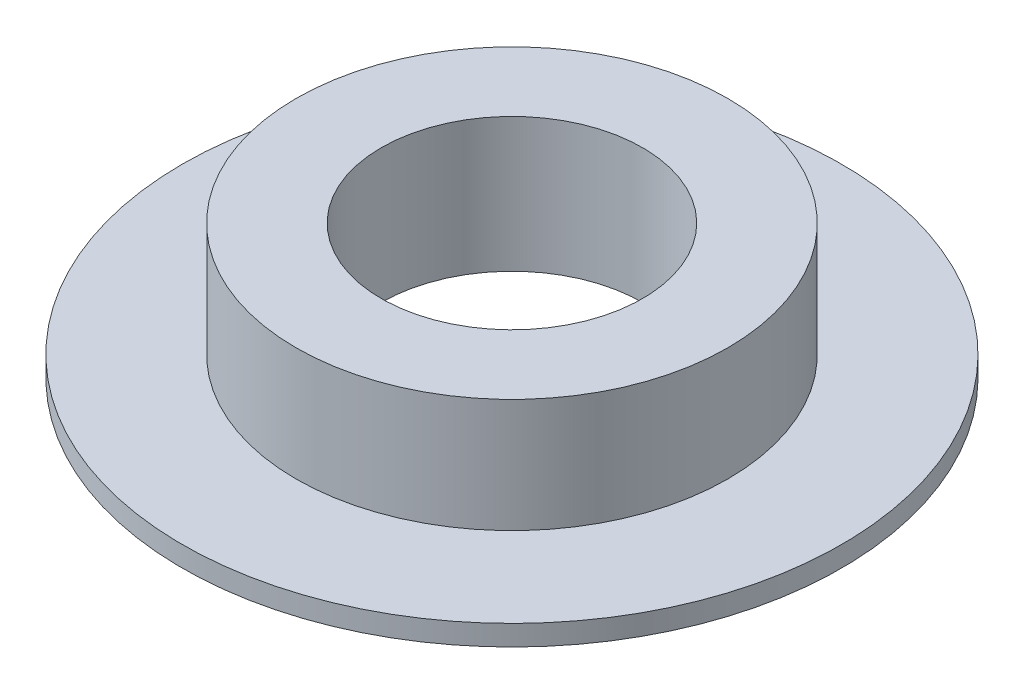
ISO-10303-21;
HEADER;
FILE_DESCRIPTION(('STEP AP214'),'2;1');
FILE_NAME('part.step','',(''),(''),'','','');
FILE_SCHEMA(('AUTOMOTIVE_DESIGN { 1 0 10303 214 1 1 1 1 }'));
ENDSEC;
DATA;
#1=APPLICATION_CONTEXT('core data for automotive mechanical design processes');
#2=APPLICATION_PROTOCOL_DEFINITION('international standard','automotive_design',2000,#1);
#3=PRODUCT_CONTEXT('',#1,'mechanical');
#4=PRODUCT('Part','Part','',(#3));
#5=PRODUCT_RELATED_PRODUCT_CATEGORY('part','',(#4));
#6=PRODUCT_DEFINITION_FORMATION('','',#4);
#7=PRODUCT_DEFINITION_CONTEXT('part definition',#1,'design');
#8=PRODUCT_DEFINITION('design','',#6,#7);
#9=PRODUCT_DEFINITION_SHAPE('','',#8);
#10=(LENGTH_UNIT() NAMED_UNIT(*) SI_UNIT(.MILLI.,.METRE.));
#11=(NAMED_UNIT(*) PLANE_ANGLE_UNIT() SI_UNIT($,.RADIAN.));
#12=(NAMED_UNIT(*) SI_UNIT($,.STERADIAN.) SOLID_ANGLE_UNIT());
#13=UNCERTAINTY_MEASURE_WITH_UNIT(LENGTH_MEASURE(1.E-05),#10,'distance_accuracy_value','');
#14=(GEOMETRIC_REPRESENTATION_CONTEXT(3) GLOBAL_UNCERTAINTY_ASSIGNED_CONTEXT((#13)) GLOBAL_UNIT_ASSIGNED_CONTEXT((#10,
#11,#12)) REPRESENTATION_CONTEXT('',''));
#15=CARTESIAN_POINT('',(0.,0.,0.));
#16=DIRECTION('',(0.,0.,1.));
#17=DIRECTION('',(1.,0.,0.));
#18=AXIS2_PLACEMENT_3D('',#15,#16,#17);
#19=CARTESIAN_POINT('',(-48.5215872800419,8.97288931788123,0.));
#20=DIRECTION('',(0.,1.,0.));
#21=DIRECTION('',(-1.,0.,0.));
#22=AXIS2_PLACEMENT_3D('',#19,#20,#21);
#23=PLANE('',#22);
#24=CARTESIAN_POINT('',(-37.0215872800419,8.97288931788123,0.));
#25=DIRECTION('',(0.,1.,0.));
#26=DIRECTION('',(-1.,0.,0.));
#27=AXIS2_PLACEMENT_3D('',#24,#25,#26);
#28=CIRCLE('',#27,19.);
#29=CARTESIAN_POINT('',(-56.0215872800419,8.97288931788123,0.));
#30=VERTEX_POINT('',#29);
#31=EDGE_CURVE('E10',#30,#30,#28,.T.);
#32=ORIENTED_EDGE('',*,*,#31,.T.);
#33=EDGE_LOOP('',(#32));
#34=FACE_BOUND('',#33,.T.);
#35=CARTESIAN_POINT('',(-37.0215872800419,8.97288931788123,0.));
#36=DIRECTION('',(0.,1.,0.));
#37=DIRECTION('',(-1.,0.,0.));
#38=AXIS2_PLACEMENT_3D('',#35,#36,#37);
#39=CIRCLE('',#38,11.5);
#40=CARTESIAN_POINT('',(-48.5215872800419,8.97288931788123,0.));
#41=VERTEX_POINT('',#40);
#42=EDGE_CURVE('E52',#41,#41,#39,.T.);
#43=ORIENTED_EDGE('',*,*,#42,.F.);
#44=EDGE_LOOP('',(#43));
#45=FACE_BOUND('',#44,.T.);
#46=ADVANCED_FACE('F30',(#34,#45),#23,.T.);
#47=CARTESIAN_POINT('',(-37.0215872800419,13.9728893178812,0.));
#48=DIRECTION('',(0.,1.,0.));
#49=DIRECTION('',(-1.,0.,0.));
#50=AXIS2_PLACEMENT_3D('',#47,#48,#49);
#51=CYLINDRICAL_SURFACE('',#50,19.);
#52=CARTESIAN_POINT('',(-37.0215872800419,-1.02711068211877,0.));
#53=DIRECTION('',(0.,1.,0.));
#54=DIRECTION('',(-1.,0.,0.));
#55=AXIS2_PLACEMENT_3D('',#52,#53,#54);
#56=CIRCLE('',#55,19.);
#57=CARTESIAN_POINT('',(-56.0215872800419,-1.02711068211877,0.));
#58=VERTEX_POINT('',#57);
#59=EDGE_CURVE('E36',#58,#58,#56,.T.);
#60=ORIENTED_EDGE('',*,*,#59,.T.);
#61=EDGE_LOOP('',(#60));
#62=FACE_BOUND('',#61,.T.);
#63=ORIENTED_EDGE('',*,*,#31,.F.);
#64=EDGE_LOOP('',(#63));
#65=FACE_BOUND('',#64,.T.);
#66=ADVANCED_FACE('F60',(#62,#65),#51,.T.);
#67=CARTESIAN_POINT('',(-56.0215872800419,-1.02711068211877,0.));
#68=DIRECTION('',(0.,1.,0.));
#69=DIRECTION('',(-1.,0.,0.));
#70=AXIS2_PLACEMENT_3D('',#67,#68,#69);
#71=PLANE('',#70);
#72=CARTESIAN_POINT('',(-37.0215872800419,-1.02711068211877,0.));
#73=DIRECTION('',(0.,1.,0.));
#74=DIRECTION('',(-1.,0.,0.));
#75=AXIS2_PLACEMENT_3D('',#72,#73,#74);
#76=CIRCLE('',#75,29.);
#77=CARTESIAN_POINT('',(-66.0215872800419,-1.02711068211877,0.));
#78=VERTEX_POINT('',#77);
#79=EDGE_CURVE('E40',#78,#78,#76,.T.);
#80=ORIENTED_EDGE('',*,*,#79,.T.);
#81=EDGE_LOOP('',(#80));
#82=FACE_BOUND('',#81,.T.);
#83=ORIENTED_EDGE('',*,*,#59,.F.);
#84=EDGE_LOOP('',(#83));
#85=FACE_BOUND('',#84,.T.);
#86=ADVANCED_FACE('F64',(#82,#85),#71,.T.);
#87=CARTESIAN_POINT('',(-37.0215872800419,13.9728893178812,0.));
#88=DIRECTION('',(0.,1.,0.));
#89=DIRECTION('',(-1.,0.,0.));
#90=AXIS2_PLACEMENT_3D('',#87,#88,#89);
#91=CYLINDRICAL_SURFACE('',#90,29.);
#92=CARTESIAN_POINT('',(-37.0215872800419,-2.82711068211877,0.));
#93=DIRECTION('',(0.,1.,0.));
#94=DIRECTION('',(-1.,0.,0.));
#95=AXIS2_PLACEMENT_3D('',#92,#93,#94);
#96=CIRCLE('',#95,29.);
#97=CARTESIAN_POINT('',(-66.0215872800419,-2.82711068211877,0.));
#98=VERTEX_POINT('',#97);
#99=EDGE_CURVE('E44',#98,#98,#96,.T.);
#100=ORIENTED_EDGE('',*,*,#99,.T.);
#101=EDGE_LOOP('',(#100));
#102=FACE_BOUND('',#101,.T.);
#103=ORIENTED_EDGE('',*,*,#79,.F.);
#104=EDGE_LOOP('',(#103));
#105=FACE_BOUND('',#104,.T.);
#106=ADVANCED_FACE('F68',(#102,#105),#91,.T.);
#107=CARTESIAN_POINT('',(-66.0215872800419,-2.82711068211877,0.));
#108=DIRECTION('',(0.,-1.,0.));
#109=DIRECTION('',(1.,0.,0.));
#110=AXIS2_PLACEMENT_3D('',#107,#108,#109);
#111=PLANE('',#110);
#112=CARTESIAN_POINT('',(-37.0215872800419,-2.82711068211877,0.));
#113=DIRECTION('',(0.,1.,0.));
#114=DIRECTION('',(-1.,0.,0.));
#115=AXIS2_PLACEMENT_3D('',#112,#113,#114);
#116=CIRCLE('',#115,11.5);
#117=CARTESIAN_POINT('',(-48.5215872800419,-2.82711068211877,0.));
#118=VERTEX_POINT('',#117);
#119=EDGE_CURVE('E49',#118,#118,#116,.T.);
#120=ORIENTED_EDGE('',*,*,#119,.T.);
#121=EDGE_LOOP('',(#120));
#122=FACE_BOUND('',#121,.T.);
#123=ORIENTED_EDGE('',*,*,#99,.F.);
#124=EDGE_LOOP('',(#123));
#125=FACE_BOUND('',#124,.T.);
#126=ADVANCED_FACE('F75',(#122,#125),#111,.T.);
#127=CARTESIAN_POINT('',(-37.0215872800419,13.9728893178812,0.));
#128=DIRECTION('',(0.,1.,0.));
#129=DIRECTION('',(-1.,0.,0.));
#130=AXIS2_PLACEMENT_3D('',#127,#128,#129);
#131=CYLINDRICAL_SURFACE('',#130,11.5);
#132=ORIENTED_EDGE('',*,*,#42,.T.);
#133=EDGE_LOOP('',(#132));
#134=FACE_BOUND('',#133,.T.);
#135=ORIENTED_EDGE('',*,*,#119,.F.);
#136=EDGE_LOOP('',(#135));
#137=FACE_BOUND('',#136,.T.);
#138=ADVANCED_FACE('F56',(#134,#137),#131,.F.);
#139=CLOSED_SHELL('',(#46,#66,#86,#106,#126,#138));
#140=MANIFOLD_SOLID_BREP('B2',#139);
#141=ADVANCED_BREP_SHAPE_REPRESENTATION('',(#18,#140),#14);
#142=SHAPE_DEFINITION_REPRESENTATION(#9,#141);
ENDSEC;
END-ISO-10303-21;
